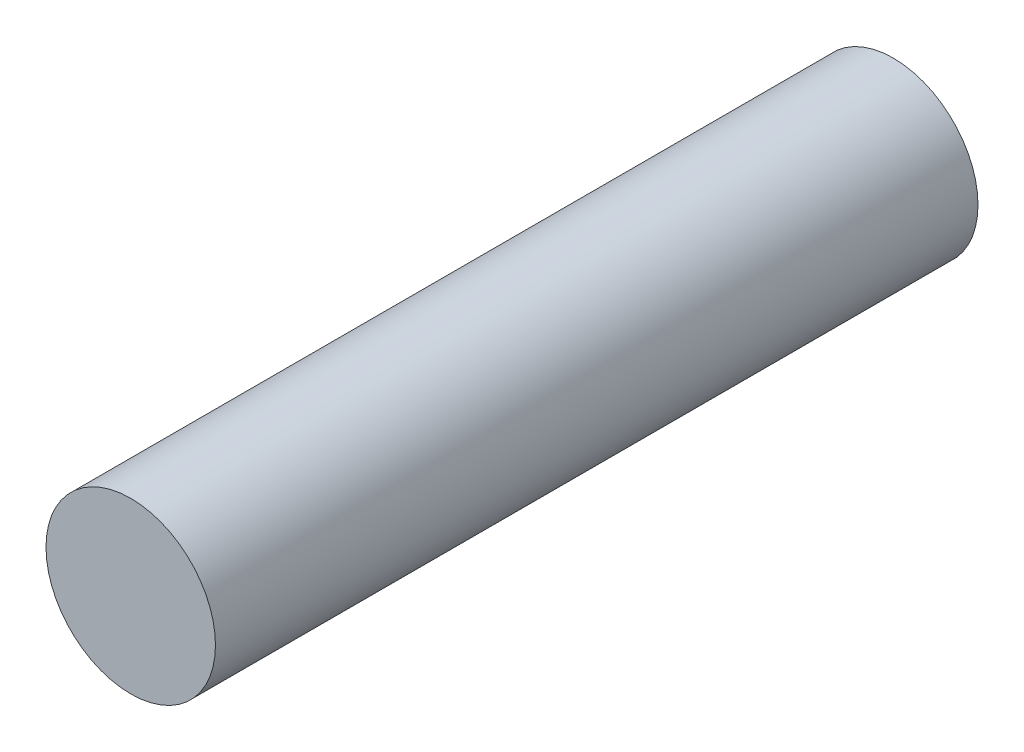
ISO-10303-21;
HEADER;
FILE_DESCRIPTION(('STEP AP214'),'2;1');
FILE_NAME('part.step','',(''),(''),'','','');
FILE_SCHEMA(('AUTOMOTIVE_DESIGN { 1 0 10303 214 1 1 1 1 }'));
ENDSEC;
DATA;
#1=APPLICATION_CONTEXT('core data for automotive mechanical design processes');
#2=APPLICATION_PROTOCOL_DEFINITION('international standard','automotive_design',2000,#1);
#3=PRODUCT_CONTEXT('',#1,'mechanical');
#4=PRODUCT('Part','Part','',(#3));
#5=PRODUCT_RELATED_PRODUCT_CATEGORY('part','',(#4));
#6=PRODUCT_DEFINITION_FORMATION('','',#4);
#7=PRODUCT_DEFINITION_CONTEXT('part definition',#1,'design');
#8=PRODUCT_DEFINITION('design','',#6,#7);
#9=PRODUCT_DEFINITION_SHAPE('','',#8);
#10=(LENGTH_UNIT() NAMED_UNIT(*) SI_UNIT(.MILLI.,.METRE.));
#11=(NAMED_UNIT(*) PLANE_ANGLE_UNIT() SI_UNIT($,.RADIAN.));
#12=(NAMED_UNIT(*) SI_UNIT($,.STERADIAN.) SOLID_ANGLE_UNIT());
#13=UNCERTAINTY_MEASURE_WITH_UNIT(LENGTH_MEASURE(1.E-05),#10,'distance_accuracy_value','');
#14=(GEOMETRIC_REPRESENTATION_CONTEXT(3) GLOBAL_UNCERTAINTY_ASSIGNED_CONTEXT((#13)) GLOBAL_UNIT_ASSIGNED_CONTEXT((#10,
#11,#12)) REPRESENTATION_CONTEXT('',''));
#15=CARTESIAN_POINT('',(0.,0.,0.));
#16=DIRECTION('',(0.,0.,1.));
#17=DIRECTION('',(1.,0.,0.));
#18=AXIS2_PLACEMENT_3D('',#15,#16,#17);
#19=CARTESIAN_POINT('',(0.,0.,45.));
#20=DIRECTION('',(0.,0.,-1.));
#21=DIRECTION('',(-1.,0.,0.));
#22=AXIS2_PLACEMENT_3D('',#19,#20,#21);
#23=CYLINDRICAL_SURFACE('',#22,10.);
#24=CARTESIAN_POINT('',(0.,0.,45.));
#25=DIRECTION('',(0.,0.,1.));
#26=DIRECTION('',(1.,0.,0.));
#27=AXIS2_PLACEMENT_3D('',#24,#25,#26);
#28=CIRCLE('',#27,10.);
#29=CARTESIAN_POINT('',(10.,0.,45.));
#30=VERTEX_POINT('',#29);
#31=EDGE_CURVE('E10',#30,#30,#28,.T.);
#32=ORIENTED_EDGE('',*,*,#31,.F.);
#33=EDGE_LOOP('',(#32));
#34=FACE_BOUND('',#33,.T.);
#35=CARTESIAN_POINT('',(0.,0.,-45.));
#36=DIRECTION('',(0.,0.,1.));
#37=DIRECTION('',(1.,0.,0.));
#38=AXIS2_PLACEMENT_3D('',#35,#36,#37);
#39=CIRCLE('',#38,10.);
#40=CARTESIAN_POINT('',(10.,0.,-45.));
#41=VERTEX_POINT('',#40);
#42=EDGE_CURVE('E40',#41,#41,#39,.T.);
#43=ORIENTED_EDGE('',*,*,#42,.T.);
#44=EDGE_LOOP('',(#43));
#45=FACE_BOUND('',#44,.T.);
#46=ADVANCED_FACE('F37',(#34,#45),#23,.T.);
#47=CARTESIAN_POINT('',(0.,0.,45.));
#48=DIRECTION('',(0.,0.,1.));
#49=DIRECTION('',(1.,0.,0.));
#50=AXIS2_PLACEMENT_3D('',#47,#48,#49);
#51=PLANE('',#50);
#52=ORIENTED_EDGE('',*,*,#31,.T.);
#53=EDGE_LOOP('',(#52));
#54=FACE_BOUND('',#53,.T.);
#55=ADVANCED_FACE('F54',(#54),#51,.T.);
#56=CARTESIAN_POINT('',(0.,0.,-45.));
#57=DIRECTION('',(0.,0.,1.));
#58=DIRECTION('',(1.,0.,0.));
#59=AXIS2_PLACEMENT_3D('',#56,#57,#58);
#60=PLANE('',#59);
#61=ORIENTED_EDGE('',*,*,#42,.F.);
#62=EDGE_LOOP('',(#61));
#63=FACE_BOUND('',#62,.T.);
#64=ADVANCED_FACE('F52',(#63),#60,.F.);
#65=CLOSED_SHELL('',(#46,#55,#64));
#66=MANIFOLD_SOLID_BREP('B2',#65);
#67=ADVANCED_BREP_SHAPE_REPRESENTATION('',(#18,#66),#14);
#68=SHAPE_DEFINITION_REPRESENTATION(#9,#67);
ENDSEC;
END-ISO-10303-21;
